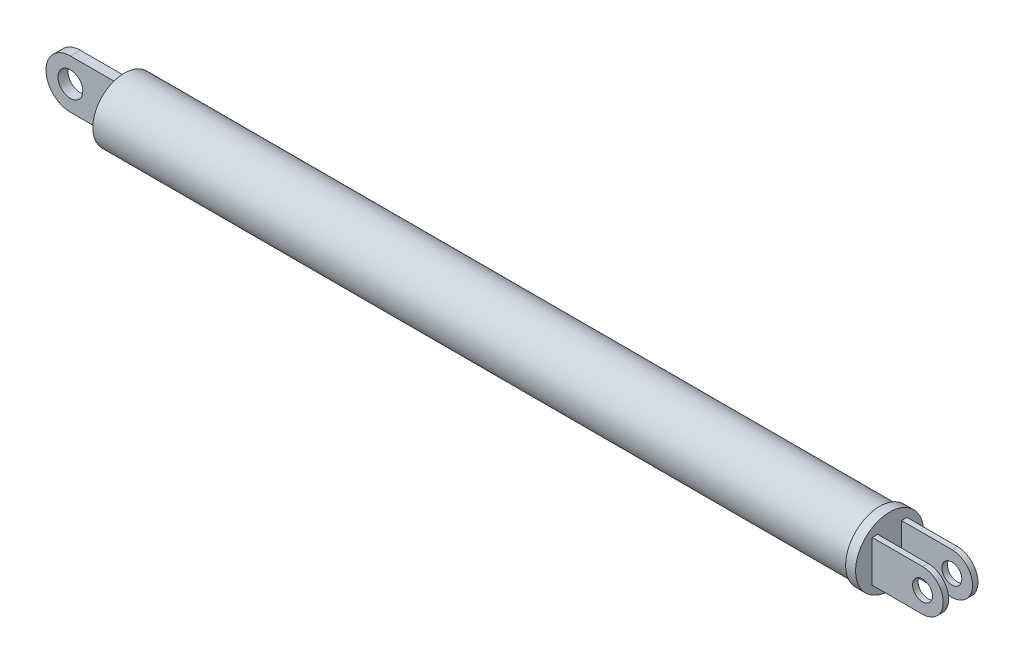
ISO-10303-21;
HEADER;
FILE_DESCRIPTION(('STEP AP214'),'2;1');
FILE_NAME('part.step','',(''),(''),'','','');
FILE_SCHEMA(('AUTOMOTIVE_DESIGN { 1 0 10303 214 1 1 1 1 }'));
ENDSEC;
DATA;
#1=APPLICATION_CONTEXT('core data for automotive mechanical design processes');
#2=APPLICATION_PROTOCOL_DEFINITION('international standard','automotive_design',2000,#1);
#3=PRODUCT_CONTEXT('',#1,'mechanical');
#4=PRODUCT('Part','Part','',(#3));
#5=PRODUCT_RELATED_PRODUCT_CATEGORY('part','',(#4));
#6=PRODUCT_DEFINITION_FORMATION('','',#4);
#7=PRODUCT_DEFINITION_CONTEXT('part definition',#1,'design');
#8=PRODUCT_DEFINITION('design','',#6,#7);
#9=PRODUCT_DEFINITION_SHAPE('','',#8);
#10=(LENGTH_UNIT() NAMED_UNIT(*) SI_UNIT(.MILLI.,.METRE.));
#11=(NAMED_UNIT(*) PLANE_ANGLE_UNIT() SI_UNIT($,.RADIAN.));
#12=(NAMED_UNIT(*) SI_UNIT($,.STERADIAN.) SOLID_ANGLE_UNIT());
#13=UNCERTAINTY_MEASURE_WITH_UNIT(LENGTH_MEASURE(1.E-05),#10,'distance_accuracy_value','');
#14=(GEOMETRIC_REPRESENTATION_CONTEXT(3) GLOBAL_UNCERTAINTY_ASSIGNED_CONTEXT((#13)) GLOBAL_UNIT_ASSIGNED_CONTEXT((#10,
#11,#12)) REPRESENTATION_CONTEXT('',''));
#15=CARTESIAN_POINT('',(0.,0.,0.));
#16=DIRECTION('',(0.,0.,1.));
#17=DIRECTION('',(1.,0.,0.));
#18=AXIS2_PLACEMENT_3D('',#15,#16,#17);
#19=CARTESIAN_POINT('',(308.,-8.32467923574905,7.));
#20=DIRECTION('',(0.,1.,0.));
#21=DIRECTION('',(-1.,0.,0.));
#22=AXIS2_PLACEMENT_3D('',#19,#20,#21);
#23=PLANE('',#22);
#24=DIRECTION('',(0.,0.,-1.));
#25=VECTOR('',#24,1.);
#26=CARTESIAN_POINT('',(328.238920727303,-8.32467923574904,7.));
#27=LINE('',#26,#25);
#28=CARTESIAN_POINT('',(328.238920727303,-8.32467923574904,-4.8012131737594));
#29=VERTEX_POINT('',#28);
#30=CARTESIAN_POINT('',(328.238920727303,-8.32467923574904,-7.));
#31=VERTEX_POINT('',#30);
#32=EDGE_CURVE('E248',#29,#31,#27,.T.);
#33=ORIENTED_EDGE('',*,*,#32,.F.);
#34=DIRECTION('',(-1.,0.,0.));
#35=VECTOR('',#34,1.);
#36=CARTESIAN_POINT('',(308.,-8.32467923574905,-4.8012131737594));
#37=LINE('',#36,#35);
#38=CARTESIAN_POINT('',(308.,-8.32467923574904,-4.8012131737594));
#39=VERTEX_POINT('',#38);
#40=EDGE_CURVE('E217',#29,#39,#37,.T.);
#41=ORIENTED_EDGE('',*,*,#40,.T.);
#42=DIRECTION('',(0.,0.,-1.));
#43=VECTOR('',#42,1.);
#44=CARTESIAN_POINT('',(308.,-8.32467923574905,7.));
#45=LINE('',#44,#43);
#46=CARTESIAN_POINT('',(308.,-8.32467923574905,-7.));
#47=VERTEX_POINT('',#46);
#48=EDGE_CURVE('E150',#39,#47,#45,.T.);
#49=ORIENTED_EDGE('',*,*,#48,.T.);
#50=DIRECTION('',(1.,0.,0.));
#51=VECTOR('',#50,1.);
#52=CARTESIAN_POINT('',(308.,-8.32467923574905,-7.));
#53=LINE('',#52,#51);
#54=EDGE_CURVE('E229',#47,#31,#53,.T.);
#55=ORIENTED_EDGE('',*,*,#54,.T.);
#56=EDGE_LOOP('',(#33,#41,#49,#55));
#57=FACE_BOUND('',#56,.T.);
#58=ADVANCED_FACE('F35',(#57),#23,.F.);
#59=CARTESIAN_POINT('',(328.238920727303,0.,7.));
#60=DIRECTION('',(0.,0.,-1.));
#61=DIRECTION('',(-1.,0.,0.));
#62=AXIS2_PLACEMENT_3D('',#59,#60,#61);
#63=CYLINDRICAL_SURFACE('',#62,8.32467923574905);
#64=DIRECTION('',(0.,0.,-1.));
#65=VECTOR('',#64,1.);
#66=CARTESIAN_POINT('',(328.238920727303,8.32467923574906,7.));
#67=LINE('',#66,#65);
#68=CARTESIAN_POINT('',(328.238920727303,8.32467923574906,-4.8012131737594));
#69=VERTEX_POINT('',#68);
#70=CARTESIAN_POINT('',(328.238920727303,8.32467923574906,-7.));
#71=VERTEX_POINT('',#70);
#72=EDGE_CURVE('E245',#69,#71,#67,.T.);
#73=ORIENTED_EDGE('',*,*,#72,.F.);
#74=CARTESIAN_POINT('',(328.238920727303,0.,-4.8012131737594));
#75=DIRECTION('',(0.,0.,-1.));
#76=DIRECTION('',(-1.,0.,0.));
#77=AXIS2_PLACEMENT_3D('',#74,#75,#76);
#78=CIRCLE('',#77,8.32467923574905);
#79=EDGE_CURVE('E214',#69,#29,#78,.T.);
#80=ORIENTED_EDGE('',*,*,#79,.T.);
#81=ORIENTED_EDGE('',*,*,#32,.T.);
#82=CARTESIAN_POINT('',(328.238920727303,0.,-7.));
#83=DIRECTION('',(0.,0.,1.));
#84=DIRECTION('',(-1.,0.,0.));
#85=AXIS2_PLACEMENT_3D('',#82,#83,#84);
#86=CIRCLE('',#85,8.32467923574905);
#87=EDGE_CURVE('E232',#31,#71,#86,.T.);
#88=ORIENTED_EDGE('',*,*,#87,.T.);
#89=EDGE_LOOP('',(#73,#80,#81,#88));
#90=FACE_BOUND('',#89,.T.);
#91=ADVANCED_FACE('F258',(#90),#63,.T.);
#92=CARTESIAN_POINT('',(308.,8.32467923574905,7.));
#93=DIRECTION('',(0.,-1.,0.));
#94=DIRECTION('',(1.,0.,0.));
#95=AXIS2_PLACEMENT_3D('',#92,#93,#94);
#96=PLANE('',#95);
#97=DIRECTION('',(0.,0.,-1.));
#98=VECTOR('',#97,1.);
#99=CARTESIAN_POINT('',(308.,8.32467923574905,7.));
#100=LINE('',#99,#98);
#101=CARTESIAN_POINT('',(308.,8.32467923574906,-4.8012131737594));
#102=VERTEX_POINT('',#101);
#103=CARTESIAN_POINT('',(308.,8.32467923574905,-7.));
#104=VERTEX_POINT('',#103);
#105=EDGE_CURVE('E60',#102,#104,#100,.T.);
#106=ORIENTED_EDGE('',*,*,#105,.F.);
#107=DIRECTION('',(1.,0.,0.));
#108=VECTOR('',#107,1.);
#109=CARTESIAN_POINT('',(308.,8.32467923574905,-4.8012131737594));
#110=LINE('',#109,#108);
#111=EDGE_CURVE('E211',#102,#69,#110,.T.);
#112=ORIENTED_EDGE('',*,*,#111,.T.);
#113=ORIENTED_EDGE('',*,*,#72,.T.);
#114=DIRECTION('',(-1.,0.,0.));
#115=VECTOR('',#114,1.);
#116=CARTESIAN_POINT('',(308.,8.32467923574905,-7.));
#117=LINE('',#116,#115);
#118=EDGE_CURVE('E235',#71,#104,#117,.T.);
#119=ORIENTED_EDGE('',*,*,#118,.T.);
#120=EDGE_LOOP('',(#106,#112,#113,#119));
#121=FACE_BOUND('',#120,.T.);
#122=ADVANCED_FACE('F254',(#121),#96,.F.);
#123=CARTESIAN_POINT('',(328.238920727303,0.,7.));
#124=DIRECTION('',(0.,0.,-1.));
#125=DIRECTION('',(-1.,0.,0.));
#126=AXIS2_PLACEMENT_3D('',#123,#124,#125);
#127=CYLINDRICAL_SURFACE('',#126,3.99999999999999);
#128=CARTESIAN_POINT('',(328.238920727303,0.,-4.8012131737594));
#129=DIRECTION('',(0.,0.,-1.));
#130=DIRECTION('',(-1.,0.,0.));
#131=AXIS2_PLACEMENT_3D('',#128,#129,#130);
#132=CIRCLE('',#131,3.99999999999999);
#133=CARTESIAN_POINT('',(324.238920727303,0.,-4.8012131737594));
#134=VERTEX_POINT('',#133);
#135=EDGE_CURVE('E39',#134,#134,#132,.T.);
#136=ORIENTED_EDGE('',*,*,#135,.F.);
#137=EDGE_LOOP('',(#136));
#138=FACE_BOUND('',#137,.T.);
#139=CARTESIAN_POINT('',(328.238920727303,0.,-7.));
#140=DIRECTION('',(0.,0.,1.));
#141=DIRECTION('',(1.,0.,0.));
#142=AXIS2_PLACEMENT_3D('',#139,#140,#141);
#143=CIRCLE('',#142,3.99999999999999);
#144=CARTESIAN_POINT('',(332.238920727303,0.,-7.));
#145=VERTEX_POINT('',#144);
#146=EDGE_CURVE('E220',#145,#145,#143,.T.);
#147=ORIENTED_EDGE('',*,*,#146,.F.);
#148=EDGE_LOOP('',(#147));
#149=FACE_BOUND('',#148,.T.);
#150=ADVANCED_FACE('F279',(#138,#149),#127,.F.);
#151=CARTESIAN_POINT('',(308.,0.,0.));
#152=DIRECTION('',(1.,0.,0.));
#153=DIRECTION('',(0.,0.,-1.));
#154=AXIS2_PLACEMENT_3D('',#151,#152,#153);
#155=PLANE('',#154);
#156=ORIENTED_EDGE('',*,*,#48,.F.);
#157=DIRECTION('',(0.,1.,0.));
#158=VECTOR('',#157,1.);
#159=CARTESIAN_POINT('',(308.,-13.7,-4.8012131737594));
#160=LINE('',#159,#158);
#161=EDGE_CURVE('E144',#39,#102,#160,.T.);
#162=ORIENTED_EDGE('',*,*,#161,.T.);
#163=ORIENTED_EDGE('',*,*,#105,.T.);
#164=DIRECTION('',(0.,-1.,0.));
#165=VECTOR('',#164,1.);
#166=CARTESIAN_POINT('',(308.,8.32467923574905,-7.));
#167=LINE('',#166,#165);
#168=EDGE_CURVE('E227',#104,#47,#167,.T.);
#169=ORIENTED_EDGE('',*,*,#168,.T.);
#170=EDGE_LOOP('',(#156,#162,#163,#169));
#171=FACE_BOUND('',#170,.T.);
#172=CARTESIAN_POINT('',(308.,8.32467923574905,7.));
#173=VERTEX_POINT('',#172);
#174=CARTESIAN_POINT('',(308.,8.32467923574905,4.80121317375941));
#175=VERTEX_POINT('',#174);
#176=EDGE_CURVE('E143',#173,#175,#100,.T.);
#177=ORIENTED_EDGE('',*,*,#176,.T.);
#178=DIRECTION('',(0.,1.,0.));
#179=VECTOR('',#178,1.);
#180=CARTESIAN_POINT('',(308.,-13.7,4.80121317375941));
#181=LINE('',#180,#179);
#182=CARTESIAN_POINT('',(308.,-8.32467923574904,4.80121317375941));
#183=VERTEX_POINT('',#182);
#184=EDGE_CURVE('E52',#183,#175,#181,.T.);
#185=ORIENTED_EDGE('',*,*,#184,.F.);
#186=CARTESIAN_POINT('',(308.,-8.32467923574905,7.));
#187=VERTEX_POINT('',#186);
#188=EDGE_CURVE('E141',#187,#183,#45,.T.);
#189=ORIENTED_EDGE('',*,*,#188,.F.);
#190=DIRECTION('',(0.,-1.,0.));
#191=VECTOR('',#190,1.);
#192=CARTESIAN_POINT('',(308.,8.32467923574905,7.));
#193=LINE('',#192,#191);
#194=EDGE_CURVE('E238',#173,#187,#193,.T.);
#195=ORIENTED_EDGE('',*,*,#194,.F.);
#196=EDGE_LOOP('',(#177,#185,#189,#195));
#197=FACE_BOUND('',#196,.T.);
#198=CARTESIAN_POINT('',(308.,0.,0.));
#199=DIRECTION('',(1.,0.,0.));
#200=DIRECTION('',(0.,0.,-1.));
#201=AXIS2_PLACEMENT_3D('',#198,#199,#200);
#202=CIRCLE('',#201,13.7);
#203=CARTESIAN_POINT('',(308.,0.,-13.7));
#204=VERTEX_POINT('',#203);
#205=EDGE_CURVE('E153',#204,#204,#202,.T.);
#206=ORIENTED_EDGE('',*,*,#205,.T.);
#207=EDGE_LOOP('',(#206));
#208=FACE_BOUND('',#207,.T.);
#209=ADVANCED_FACE('F138',(#171,#197,#208),#155,.T.);
#210=CARTESIAN_POINT('',(0.,0.,0.));
#211=DIRECTION('',(1.,0.,0.));
#212=DIRECTION('',(0.,0.,-1.));
#213=AXIS2_PLACEMENT_3D('',#210,#211,#212);
#214=PLANE('',#213);
#215=CARTESIAN_POINT('',(0.,0.,0.));
#216=DIRECTION('',(1.,0.,0.));
#217=DIRECTION('',(0.,0.,-1.));
#218=AXIS2_PLACEMENT_3D('',#215,#216,#217);
#219=CIRCLE('',#218,12.7);
#220=CARTESIAN_POINT('',(0.,0.,-12.7));
#221=VERTEX_POINT('',#220);
#222=EDGE_CURVE('E44',#221,#221,#219,.T.);
#223=ORIENTED_EDGE('',*,*,#222,.F.);
#224=EDGE_LOOP('',(#223));
#225=FACE_BOUND('',#224,.T.);
#226=DIRECTION('',(0.,0.,-1.));
#227=VECTOR('',#226,1.);
#228=CARTESIAN_POINT('',(0.,9.80568754770044,2.));
#229=LINE('',#228,#227);
#230=CARTESIAN_POINT('',(0.,9.80568754770044,2.));
#231=VERTEX_POINT('',#230);
#232=CARTESIAN_POINT('',(0.,9.80568754770044,-2.));
#233=VERTEX_POINT('',#232);
#234=EDGE_CURVE('E196',#231,#233,#229,.T.);
#235=ORIENTED_EDGE('',*,*,#234,.F.);
#236=DIRECTION('',(0.,1.,0.));
#237=VECTOR('',#236,1.);
#238=CARTESIAN_POINT('',(0.,9.80568754770044,2.));
#239=LINE('',#238,#237);
#240=CARTESIAN_POINT('',(0.,-9.80568754770044,2.));
#241=VERTEX_POINT('',#240);
#242=EDGE_CURVE('E177',#241,#231,#239,.T.);
#243=ORIENTED_EDGE('',*,*,#242,.F.);
#244=DIRECTION('',(0.,0.,-1.));
#245=VECTOR('',#244,1.);
#246=CARTESIAN_POINT('',(0.,-9.80568754770044,2.));
#247=LINE('',#246,#245);
#248=CARTESIAN_POINT('',(0.,-9.80568754770044,-2.));
#249=VERTEX_POINT('',#248);
#250=EDGE_CURVE('E188',#241,#249,#247,.T.);
#251=ORIENTED_EDGE('',*,*,#250,.T.);
#252=DIRECTION('',(0.,1.,0.));
#253=VECTOR('',#252,1.);
#254=CARTESIAN_POINT('',(0.,9.80568754770044,-2.));
#255=LINE('',#254,#253);
#256=EDGE_CURVE('E168',#249,#233,#255,.T.);
#257=ORIENTED_EDGE('',*,*,#256,.T.);
#258=EDGE_LOOP('',(#235,#243,#251,#257));
#259=FACE_BOUND('',#258,.T.);
#260=ADVANCED_FACE('F315',(#225,#259),#214,.F.);
#261=CARTESIAN_POINT('',(304.,0.,0.));
#262=DIRECTION('',(-1.,0.,0.));
#263=DIRECTION('',(0.,0.,1.));
#264=AXIS2_PLACEMENT_3D('',#261,#262,#263);
#265=CYLINDRICAL_SURFACE('',#264,12.7);
#266=CARTESIAN_POINT('',(304.,0.,0.));
#267=DIRECTION('',(1.,0.,0.));
#268=DIRECTION('',(0.,0.,-1.));
#269=AXIS2_PLACEMENT_3D('',#266,#267,#268);
#270=CIRCLE('',#269,12.7);
#271=CARTESIAN_POINT('',(304.,0.,-12.7));
#272=VERTEX_POINT('',#271);
#273=EDGE_CURVE('E11',#272,#272,#270,.T.);
#274=ORIENTED_EDGE('',*,*,#273,.F.);
#275=EDGE_LOOP('',(#274));
#276=FACE_BOUND('',#275,.T.);
#277=ORIENTED_EDGE('',*,*,#222,.T.);
#278=EDGE_LOOP('',(#277));
#279=FACE_BOUND('',#278,.T.);
#280=ADVANCED_FACE('F37',(#276,#279),#265,.T.);
#281=CARTESIAN_POINT('',(-19.7330944718316,0.,2.));
#282=DIRECTION('',(0.,0.,1.));
#283=DIRECTION('',(1.,0.,0.));
#284=AXIS2_PLACEMENT_3D('',#281,#282,#283);
#285=PLANE('',#284);
#286=ORIENTED_EDGE('',*,*,#242,.T.);
#287=DIRECTION('',(-1.,0.,0.));
#288=VECTOR('',#287,1.);
#289=CARTESIAN_POINT('',(0.,9.80568754770044,2.));
#290=LINE('',#289,#288);
#291=CARTESIAN_POINT('',(-19.7330944718316,9.80568754770044,2.));
#292=VERTEX_POINT('',#291);
#293=EDGE_CURVE('E181',#231,#292,#290,.T.);
#294=ORIENTED_EDGE('',*,*,#293,.T.);
#295=CARTESIAN_POINT('',(-19.7330944718316,0.,2.));
#296=DIRECTION('',(0.,0.,1.));
#297=DIRECTION('',(1.,0.,0.));
#298=AXIS2_PLACEMENT_3D('',#295,#296,#297);
#299=CIRCLE('',#298,9.80568754770044);
#300=CARTESIAN_POINT('',(-19.7330944718316,-9.80568754770044,2.));
#301=VERTEX_POINT('',#300);
#302=EDGE_CURVE('E183',#292,#301,#299,.T.);
#303=ORIENTED_EDGE('',*,*,#302,.T.);
#304=DIRECTION('',(1.,0.,0.));
#305=VECTOR('',#304,1.);
#306=CARTESIAN_POINT('',(0.,-9.80568754770044,2.));
#307=LINE('',#306,#305);
#308=EDGE_CURVE('E185',#301,#241,#307,.T.);
#309=ORIENTED_EDGE('',*,*,#308,.T.);
#310=EDGE_LOOP('',(#286,#294,#303,#309));
#311=FACE_BOUND('',#310,.T.);
#312=CARTESIAN_POINT('',(-19.7330944718316,0.,2.));
#313=DIRECTION('',(0.,0.,1.));
#314=DIRECTION('',(1.,0.,0.));
#315=AXIS2_PLACEMENT_3D('',#312,#313,#314);
#316=CIRCLE('',#315,5.);
#317=CARTESIAN_POINT('',(-14.7330944718316,0.,2.));
#318=VERTEX_POINT('',#317);
#319=EDGE_CURVE('E165',#318,#318,#316,.T.);
#320=ORIENTED_EDGE('',*,*,#319,.F.);
#321=EDGE_LOOP('',(#320));
#322=FACE_BOUND('',#321,.T.);
#323=ADVANCED_FACE('F338',(#311,#322),#285,.T.);
#324=CARTESIAN_POINT('',(-19.7330944718316,0.,-2.));
#325=DIRECTION('',(0.,0.,1.));
#326=DIRECTION('',(1.,0.,0.));
#327=AXIS2_PLACEMENT_3D('',#324,#325,#326);
#328=PLANE('',#327);
#329=ORIENTED_EDGE('',*,*,#256,.F.);
#330=DIRECTION('',(1.,0.,0.));
#331=VECTOR('',#330,1.);
#332=CARTESIAN_POINT('',(0.,-9.80568754770044,-2.));
#333=LINE('',#332,#331);
#334=CARTESIAN_POINT('',(-19.7330944718316,-9.80568754770044,-2.));
#335=VERTEX_POINT('',#334);
#336=EDGE_CURVE('E174',#335,#249,#333,.T.);
#337=ORIENTED_EDGE('',*,*,#336,.F.);
#338=CARTESIAN_POINT('',(-19.7330944718316,0.,-2.));
#339=DIRECTION('',(0.,0.,1.));
#340=DIRECTION('',(1.,0.,0.));
#341=AXIS2_PLACEMENT_3D('',#338,#339,#340);
#342=CIRCLE('',#341,9.80568754770044);
#343=CARTESIAN_POINT('',(-19.7330944718316,9.80568754770044,-2.));
#344=VERTEX_POINT('',#343);
#345=EDGE_CURVE('E172',#344,#335,#342,.T.);
#346=ORIENTED_EDGE('',*,*,#345,.F.);
#347=DIRECTION('',(-1.,0.,0.));
#348=VECTOR('',#347,1.);
#349=CARTESIAN_POINT('',(0.,9.80568754770044,-2.));
#350=LINE('',#349,#348);
#351=EDGE_CURVE('E170',#233,#344,#350,.T.);
#352=ORIENTED_EDGE('',*,*,#351,.F.);
#353=EDGE_LOOP('',(#329,#337,#346,#352));
#354=FACE_BOUND('',#353,.T.);
#355=CARTESIAN_POINT('',(-19.7330944718316,0.,-2.));
#356=DIRECTION('',(0.,0.,1.));
#357=DIRECTION('',(1.,0.,0.));
#358=AXIS2_PLACEMENT_3D('',#355,#356,#357);
#359=CIRCLE('',#358,5.);
#360=CARTESIAN_POINT('',(-14.7330944718316,0.,-2.));
#361=VERTEX_POINT('',#360);
#362=EDGE_CURVE('E162',#361,#361,#359,.T.);
#363=ORIENTED_EDGE('',*,*,#362,.T.);
#364=EDGE_LOOP('',(#363));
#365=FACE_BOUND('',#364,.T.);
#366=ADVANCED_FACE('F334',(#354,#365),#328,.F.);
#367=CARTESIAN_POINT('',(0.,9.80568754770044,2.));
#368=DIRECTION('',(0.,-1.,0.));
#369=DIRECTION('',(1.,0.,0.));
#370=AXIS2_PLACEMENT_3D('',#367,#368,#369);
#371=PLANE('',#370);
#372=ORIENTED_EDGE('',*,*,#351,.T.);
#373=DIRECTION('',(0.,0.,-1.));
#374=VECTOR('',#373,1.);
#375=CARTESIAN_POINT('',(-19.7330944718316,9.80568754770044,2.));
#376=LINE('',#375,#374);
#377=EDGE_CURVE('E193',#292,#344,#376,.T.);
#378=ORIENTED_EDGE('',*,*,#377,.F.);
#379=ORIENTED_EDGE('',*,*,#293,.F.);
#380=ORIENTED_EDGE('',*,*,#234,.T.);
#381=EDGE_LOOP('',(#372,#378,#379,#380));
#382=FACE_BOUND('',#381,.T.);
#383=ADVANCED_FACE('F337',(#382),#371,.F.);
#384=CARTESIAN_POINT('',(-19.7330944718316,0.,2.));
#385=DIRECTION('',(0.,0.,-1.));
#386=DIRECTION('',(-1.,0.,0.));
#387=AXIS2_PLACEMENT_3D('',#384,#385,#386);
#388=CYLINDRICAL_SURFACE('',#387,9.80568754770044);
#389=ORIENTED_EDGE('',*,*,#345,.T.);
#390=DIRECTION('',(0.,0.,-1.));
#391=VECTOR('',#390,1.);
#392=CARTESIAN_POINT('',(-19.7330944718316,-9.80568754770044,2.));
#393=LINE('',#392,#391);
#394=EDGE_CURVE('E190',#301,#335,#393,.T.);
#395=ORIENTED_EDGE('',*,*,#394,.F.);
#396=ORIENTED_EDGE('',*,*,#302,.F.);
#397=ORIENTED_EDGE('',*,*,#377,.T.);
#398=EDGE_LOOP('',(#389,#395,#396,#397));
#399=FACE_BOUND('',#398,.T.);
#400=ADVANCED_FACE('F345',(#399),#388,.T.);
#401=CARTESIAN_POINT('',(0.,-9.80568754770044,2.));
#402=DIRECTION('',(0.,1.,0.));
#403=DIRECTION('',(-1.,0.,0.));
#404=AXIS2_PLACEMENT_3D('',#401,#402,#403);
#405=PLANE('',#404);
#406=ORIENTED_EDGE('',*,*,#336,.T.);
#407=ORIENTED_EDGE('',*,*,#250,.F.);
#408=ORIENTED_EDGE('',*,*,#308,.F.);
#409=ORIENTED_EDGE('',*,*,#394,.T.);
#410=EDGE_LOOP('',(#406,#407,#408,#409));
#411=FACE_BOUND('',#410,.T.);
#412=ADVANCED_FACE('F332',(#411),#405,.F.);
#413=CARTESIAN_POINT('',(-19.7330944718316,0.,2.));
#414=DIRECTION('',(0.,0.,-1.));
#415=DIRECTION('',(-1.,0.,0.));
#416=AXIS2_PLACEMENT_3D('',#413,#414,#415);
#417=CYLINDRICAL_SURFACE('',#416,5.);
#418=ORIENTED_EDGE('',*,*,#319,.T.);
#419=EDGE_LOOP('',(#418));
#420=FACE_BOUND('',#419,.T.);
#421=ORIENTED_EDGE('',*,*,#362,.F.);
#422=EDGE_LOOP('',(#421));
#423=FACE_BOUND('',#422,.T.);
#424=ADVANCED_FACE('F329',(#420,#423),#417,.F.);
#425=CARTESIAN_POINT('',(304.,0.,0.));
#426=DIRECTION('',(1.,0.,0.));
#427=DIRECTION('',(0.,0.,-1.));
#428=AXIS2_PLACEMENT_3D('',#425,#426,#427);
#429=PLANE('',#428);
#430=CARTESIAN_POINT('',(304.,0.,0.));
#431=DIRECTION('',(1.,0.,0.));
#432=DIRECTION('',(0.,0.,-1.));
#433=AXIS2_PLACEMENT_3D('',#430,#431,#432);
#434=CIRCLE('',#433,13.7);
#435=CARTESIAN_POINT('',(304.,0.,-13.7));
#436=VERTEX_POINT('',#435);
#437=EDGE_CURVE('E149',#436,#436,#434,.T.);
#438=ORIENTED_EDGE('',*,*,#437,.F.);
#439=EDGE_LOOP('',(#438));
#440=FACE_BOUND('',#439,.T.);
#441=ORIENTED_EDGE('',*,*,#273,.T.);
#442=EDGE_LOOP('',(#441));
#443=FACE_BOUND('',#442,.T.);
#444=ADVANCED_FACE('F325',(#440,#443),#429,.F.);
#445=CARTESIAN_POINT('',(308.,0.,0.));
#446=DIRECTION('',(-1.,0.,0.));
#447=DIRECTION('',(0.,0.,1.));
#448=AXIS2_PLACEMENT_3D('',#445,#446,#447);
#449=CYLINDRICAL_SURFACE('',#448,13.7);
#450=ORIENTED_EDGE('',*,*,#205,.F.);
#451=EDGE_LOOP('',(#450));
#452=FACE_BOUND('',#451,.T.);
#453=ORIENTED_EDGE('',*,*,#437,.T.);
#454=EDGE_LOOP('',(#453));
#455=FACE_BOUND('',#454,.T.);
#456=ADVANCED_FACE('F300',(#452,#455),#449,.T.);
#457=CARTESIAN_POINT('',(328.238920727303,0.,7.));
#458=DIRECTION('',(0.,0.,-1.));
#459=DIRECTION('',(-1.,0.,0.));
#460=AXIS2_PLACEMENT_3D('',#457,#458,#459);
#461=PLANE('',#460);
#462=ORIENTED_EDGE('',*,*,#194,.T.);
#463=DIRECTION('',(1.,0.,0.));
#464=VECTOR('',#463,1.);
#465=CARTESIAN_POINT('',(308.,-8.32467923574905,7.));
#466=LINE('',#465,#464);
#467=CARTESIAN_POINT('',(328.238920727303,-8.32467923574904,7.));
#468=VERTEX_POINT('',#467);
#469=EDGE_CURVE('E147',#187,#468,#466,.T.);
#470=ORIENTED_EDGE('',*,*,#469,.T.);
#471=CARTESIAN_POINT('',(328.238920727303,0.,7.));
#472=DIRECTION('',(0.,0.,1.));
#473=DIRECTION('',(-1.,0.,0.));
#474=AXIS2_PLACEMENT_3D('',#471,#472,#473);
#475=CIRCLE('',#474,8.32467923574905);
#476=CARTESIAN_POINT('',(328.238920727303,8.32467923574906,7.));
#477=VERTEX_POINT('',#476);
#478=EDGE_CURVE('E241',#468,#477,#475,.T.);
#479=ORIENTED_EDGE('',*,*,#478,.T.);
#480=DIRECTION('',(-1.,0.,0.));
#481=VECTOR('',#480,1.);
#482=CARTESIAN_POINT('',(308.,8.32467923574905,7.));
#483=LINE('',#482,#481);
#484=EDGE_CURVE('E243',#477,#173,#483,.T.);
#485=ORIENTED_EDGE('',*,*,#484,.T.);
#486=EDGE_LOOP('',(#462,#470,#479,#485));
#487=FACE_BOUND('',#486,.T.);
#488=CARTESIAN_POINT('',(328.238920727303,0.,7.));
#489=DIRECTION('',(0.,0.,1.));
#490=DIRECTION('',(1.,0.,0.));
#491=AXIS2_PLACEMENT_3D('',#488,#489,#490);
#492=CIRCLE('',#491,3.99999999999999);
#493=CARTESIAN_POINT('',(332.238920727303,0.,7.));
#494=VERTEX_POINT('',#493);
#495=EDGE_CURVE('E223',#494,#494,#492,.T.);
#496=ORIENTED_EDGE('',*,*,#495,.F.);
#497=EDGE_LOOP('',(#496));
#498=FACE_BOUND('',#497,.T.);
#499=ADVANCED_FACE('F295',(#487,#498),#461,.F.);
#500=CARTESIAN_POINT('',(328.238920727303,0.,-7.));
#501=DIRECTION('',(0.,0.,-1.));
#502=DIRECTION('',(-1.,0.,0.));
#503=AXIS2_PLACEMENT_3D('',#500,#501,#502);
#504=PLANE('',#503);
#505=ORIENTED_EDGE('',*,*,#168,.F.);
#506=ORIENTED_EDGE('',*,*,#118,.F.);
#507=ORIENTED_EDGE('',*,*,#87,.F.);
#508=ORIENTED_EDGE('',*,*,#54,.F.);
#509=EDGE_LOOP('',(#505,#506,#507,#508));
#510=FACE_BOUND('',#509,.T.);
#511=ORIENTED_EDGE('',*,*,#146,.T.);
#512=EDGE_LOOP('',(#511));
#513=FACE_BOUND('',#512,.T.);
#514=ADVANCED_FACE('F262',(#510,#513),#504,.T.);
#515=ORIENTED_EDGE('',*,*,#188,.T.);
#516=DIRECTION('',(1.,0.,0.));
#517=VECTOR('',#516,1.);
#518=CARTESIAN_POINT('',(308.,-8.32467923574905,4.80121317375941));
#519=LINE('',#518,#517);
#520=CARTESIAN_POINT('',(328.238920727303,-8.32467923574904,4.80121317375941));
#521=VERTEX_POINT('',#520);
#522=EDGE_CURVE('E126',#183,#521,#519,.T.);
#523=ORIENTED_EDGE('',*,*,#522,.T.);
#524=EDGE_CURVE('E155',#468,#521,#27,.T.);
#525=ORIENTED_EDGE('',*,*,#524,.F.);
#526=ORIENTED_EDGE('',*,*,#469,.F.);
#527=EDGE_LOOP('',(#515,#523,#525,#526));
#528=FACE_BOUND('',#527,.T.);
#529=ADVANCED_FACE('F146',(#528),#23,.F.);
#530=ORIENTED_EDGE('',*,*,#524,.T.);
#531=CARTESIAN_POINT('',(328.238920727303,0.,4.80121317375941));
#532=DIRECTION('',(0.,0.,1.));
#533=DIRECTION('',(1.,0.,0.));
#534=AXIS2_PLACEMENT_3D('',#531,#532,#533);
#535=CIRCLE('',#534,8.32467923574905);
#536=CARTESIAN_POINT('',(328.238920727303,8.32467923574906,4.80121317375941));
#537=VERTEX_POINT('',#536);
#538=EDGE_CURVE('E129',#521,#537,#535,.T.);
#539=ORIENTED_EDGE('',*,*,#538,.T.);
#540=EDGE_CURVE('E246',#477,#537,#67,.T.);
#541=ORIENTED_EDGE('',*,*,#540,.F.);
#542=ORIENTED_EDGE('',*,*,#478,.F.);
#543=EDGE_LOOP('',(#530,#539,#541,#542));
#544=FACE_BOUND('',#543,.T.);
#545=ADVANCED_FACE('F287',(#544),#63,.T.);
#546=ORIENTED_EDGE('',*,*,#540,.T.);
#547=DIRECTION('',(-1.,0.,0.));
#548=VECTOR('',#547,1.);
#549=CARTESIAN_POINT('',(308.,8.32467923574905,4.80121317375941));
#550=LINE('',#549,#548);
#551=EDGE_CURVE('E203',#537,#175,#550,.T.);
#552=ORIENTED_EDGE('',*,*,#551,.T.);
#553=ORIENTED_EDGE('',*,*,#176,.F.);
#554=ORIENTED_EDGE('',*,*,#484,.F.);
#555=EDGE_LOOP('',(#546,#552,#553,#554));
#556=FACE_BOUND('',#555,.T.);
#557=ADVANCED_FACE('F276',(#556),#96,.F.);
#558=CARTESIAN_POINT('',(328.238920727303,0.,4.80121317375941));
#559=DIRECTION('',(0.,0.,1.));
#560=DIRECTION('',(1.,0.,0.));
#561=AXIS2_PLACEMENT_3D('',#558,#559,#560);
#562=CIRCLE('',#561,3.99999999999999);
#563=CARTESIAN_POINT('',(332.238920727303,0.,4.80121317375941));
#564=VERTEX_POINT('',#563);
#565=EDGE_CURVE('E201',#564,#564,#562,.T.);
#566=ORIENTED_EDGE('',*,*,#565,.F.);
#567=EDGE_LOOP('',(#566));
#568=FACE_BOUND('',#567,.T.);
#569=ORIENTED_EDGE('',*,*,#495,.T.);
#570=EDGE_LOOP('',(#569));
#571=FACE_BOUND('',#570,.T.);
#572=ADVANCED_FACE('F268',(#568,#571),#127,.F.);
#573=CARTESIAN_POINT('',(308.,-13.7,-4.8012131737594));
#574=DIRECTION('',(0.,0.,-1.));
#575=DIRECTION('',(-1.,0.,0.));
#576=AXIS2_PLACEMENT_3D('',#573,#574,#575);
#577=PLANE('',#576);
#578=ORIENTED_EDGE('',*,*,#135,.T.);
#579=EDGE_LOOP('',(#578));
#580=FACE_BOUND('',#579,.T.);
#581=ORIENTED_EDGE('',*,*,#79,.F.);
#582=ORIENTED_EDGE('',*,*,#111,.F.);
#583=ORIENTED_EDGE('',*,*,#161,.F.);
#584=ORIENTED_EDGE('',*,*,#40,.F.);
#585=EDGE_LOOP('',(#581,#582,#583,#584));
#586=FACE_BOUND('',#585,.T.);
#587=ADVANCED_FACE('F266',(#580,#586),#577,.F.);
#588=CARTESIAN_POINT('',(308.,-13.7,4.80121317375941));
#589=DIRECTION('',(0.,0.,1.));
#590=DIRECTION('',(1.,0.,0.));
#591=AXIS2_PLACEMENT_3D('',#588,#589,#590);
#592=PLANE('',#591);
#593=ORIENTED_EDGE('',*,*,#565,.T.);
#594=EDGE_LOOP('',(#593));
#595=FACE_BOUND('',#594,.T.);
#596=ORIENTED_EDGE('',*,*,#184,.T.);
#597=ORIENTED_EDGE('',*,*,#551,.F.);
#598=ORIENTED_EDGE('',*,*,#538,.F.);
#599=ORIENTED_EDGE('',*,*,#522,.F.);
#600=EDGE_LOOP('',(#596,#597,#598,#599));
#601=FACE_BOUND('',#600,.T.);
#602=ADVANCED_FACE('F127',(#595,#601),#592,.F.);
#603=CLOSED_SHELL('',(#58,#91,#122,#150,#209,#260,#280,#323,#366,#383,#400,#412,#424,#444,#456,
#499,#514,#529,#545,#557,#572,#587,#602));
#604=MANIFOLD_SOLID_BREP('B2',#603);
#605=ADVANCED_BREP_SHAPE_REPRESENTATION('',(#18,#604),#14);
#606=SHAPE_DEFINITION_REPRESENTATION(#9,#605);
ENDSEC;
END-ISO-10303-21;
